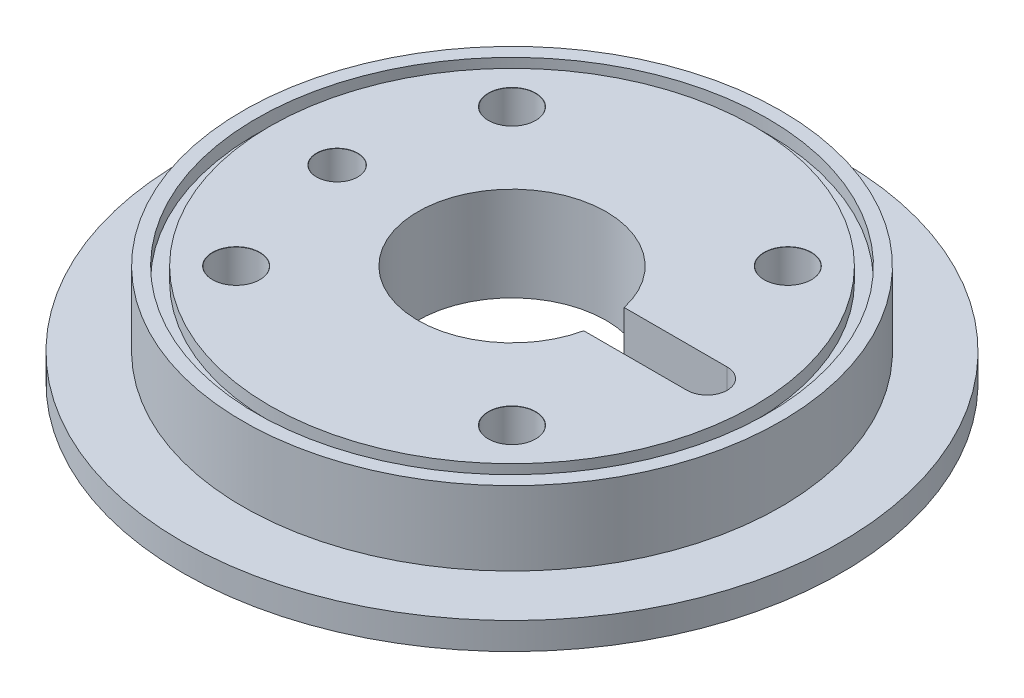
ISO-10303-21;
HEADER;
FILE_DESCRIPTION(('STEP AP214'),'2;1');
FILE_NAME('part.step','',(''),(''),'','','');
FILE_SCHEMA(('AUTOMOTIVE_DESIGN { 1 0 10303 214 1 1 1 1 }'));
ENDSEC;
DATA;
#1=APPLICATION_CONTEXT('core data for automotive mechanical design processes');
#2=APPLICATION_PROTOCOL_DEFINITION('international standard','automotive_design',2000,#1);
#3=PRODUCT_CONTEXT('',#1,'mechanical');
#4=PRODUCT('Part','Part','',(#3));
#5=PRODUCT_RELATED_PRODUCT_CATEGORY('part','',(#4));
#6=PRODUCT_DEFINITION_FORMATION('','',#4);
#7=PRODUCT_DEFINITION_CONTEXT('part definition',#1,'design');
#8=PRODUCT_DEFINITION('design','',#6,#7);
#9=PRODUCT_DEFINITION_SHAPE('','',#8);
#10=(LENGTH_UNIT() NAMED_UNIT(*) SI_UNIT(.MILLI.,.METRE.));
#11=(NAMED_UNIT(*) PLANE_ANGLE_UNIT() SI_UNIT($,.RADIAN.));
#12=(NAMED_UNIT(*) SI_UNIT($,.STERADIAN.) SOLID_ANGLE_UNIT());
#13=UNCERTAINTY_MEASURE_WITH_UNIT(LENGTH_MEASURE(1.E-05),#10,'distance_accuracy_value','');
#14=(GEOMETRIC_REPRESENTATION_CONTEXT(3) GLOBAL_UNCERTAINTY_ASSIGNED_CONTEXT((#13)) GLOBAL_UNIT_ASSIGNED_CONTEXT((#10,
#11,#12)) REPRESENTATION_CONTEXT('',''));
#15=CARTESIAN_POINT('',(0.,0.,0.));
#16=DIRECTION('',(0.,0.,1.));
#17=DIRECTION('',(1.,0.,0.));
#18=AXIS2_PLACEMENT_3D('',#15,#16,#17);
#19=CARTESIAN_POINT('',(-36.,15.,0.));
#20=DIRECTION('',(0.,-1.,0.));
#21=DIRECTION('',(0.,0.,-1.));
#22=AXIS2_PLACEMENT_3D('',#19,#20,#21);
#23=PLANE('',#22);
#24=CARTESIAN_POINT('',(20.5060966544099,15.,20.5060966544099));
#25=DIRECTION('',(0.,1.,0.));
#26=DIRECTION('',(0.,0.,1.));
#27=AXIS2_PLACEMENT_3D('',#24,#25,#26);
#28=CIRCLE('',#27,3.525);
#29=CARTESIAN_POINT('',(20.5060966544099,15.,24.0310966544099));
#30=VERTEX_POINT('',#29);
#31=EDGE_CURVE('E377',#30,#30,#28,.T.);
#32=ORIENTED_EDGE('',*,*,#31,.F.);
#33=EDGE_LOOP('',(#32));
#34=FACE_BOUND('',#33,.T.);
#35=CARTESIAN_POINT('',(20.5060966544098,15.,-20.5060966544099));
#36=DIRECTION('',(0.,1.,0.));
#37=DIRECTION('',(0.,0.,1.));
#38=AXIS2_PLACEMENT_3D('',#35,#36,#37);
#39=CIRCLE('',#38,3.525);
#40=CARTESIAN_POINT('',(20.5060966544098,15.,-16.9810966544099));
#41=VERTEX_POINT('',#40);
#42=EDGE_CURVE('E389',#41,#41,#39,.T.);
#43=ORIENTED_EDGE('',*,*,#42,.F.);
#44=EDGE_LOOP('',(#43));
#45=FACE_BOUND('',#44,.T.);
#46=CARTESIAN_POINT('',(0.,15.,0.));
#47=DIRECTION('',(0.,-1.,0.));
#48=DIRECTION('',(0.,0.,-1.));
#49=AXIS2_PLACEMENT_3D('',#46,#47,#48);
#50=CIRCLE('',#49,36.);
#51=CARTESIAN_POINT('',(0.,15.,-36.));
#52=VERTEX_POINT('',#51);
#53=EDGE_CURVE('E172',#52,#52,#50,.T.);
#54=ORIENTED_EDGE('',*,*,#53,.F.);
#55=EDGE_LOOP('',(#54));
#56=FACE_BOUND('',#55,.T.);
#57=CARTESIAN_POINT('',(0.,15.,0.));
#58=DIRECTION('',(0.,-1.,0.));
#59=DIRECTION('',(0.,0.,-1.));
#60=AXIS2_PLACEMENT_3D('',#57,#58,#59);
#61=CIRCLE('',#60,14.);
#62=CARTESIAN_POINT('',(13.6747943311773,15.,3.));
#63=VERTEX_POINT('',#62);
#64=CARTESIAN_POINT('',(13.6747943311773,15.,-3.));
#65=VERTEX_POINT('',#64);
#66=EDGE_CURVE('E176',#63,#65,#61,.T.);
#67=ORIENTED_EDGE('',*,*,#66,.T.);
#68=DIRECTION('',(-1.,0.,0.));
#69=VECTOR('',#68,1.);
#70=CARTESIAN_POINT('',(0.,15.,-3.));
#71=LINE('',#70,#69);
#72=CARTESIAN_POINT('',(29.,15.,-3.));
#73=VERTEX_POINT('',#72);
#74=EDGE_CURVE('E89',#73,#65,#71,.T.);
#75=ORIENTED_EDGE('',*,*,#74,.F.);
#76=CARTESIAN_POINT('',(29.,15.,0.));
#77=DIRECTION('',(0.,1.,0.));
#78=DIRECTION('',(0.,0.,1.));
#79=AXIS2_PLACEMENT_3D('',#76,#77,#78);
#80=CIRCLE('',#79,3.);
#81=CARTESIAN_POINT('',(29.,15.,3.));
#82=VERTEX_POINT('',#81);
#83=EDGE_CURVE('E108',#82,#73,#80,.T.);
#84=ORIENTED_EDGE('',*,*,#83,.F.);
#85=DIRECTION('',(-1.,0.,0.));
#86=VECTOR('',#85,1.);
#87=CARTESIAN_POINT('',(-36.,15.,3.));
#88=LINE('',#87,#86);
#89=EDGE_CURVE('E49',#82,#63,#88,.T.);
#90=ORIENTED_EDGE('',*,*,#89,.T.);
#91=EDGE_LOOP('',(#67,#75,#84,#90));
#92=FACE_BOUND('',#91,.T.);
#93=CARTESIAN_POINT('',(-20.5060966544098,15.,20.5060966544099));
#94=DIRECTION('',(0.,1.,0.));
#95=DIRECTION('',(0.,0.,1.));
#96=AXIS2_PLACEMENT_3D('',#93,#94,#95);
#97=CIRCLE('',#96,3.525);
#98=CARTESIAN_POINT('',(-20.5060966544098,15.,24.0310966544099));
#99=VERTEX_POINT('',#98);
#100=EDGE_CURVE('E365',#99,#99,#97,.T.);
#101=ORIENTED_EDGE('',*,*,#100,.F.);
#102=EDGE_LOOP('',(#101));
#103=FACE_BOUND('',#102,.T.);
#104=CARTESIAN_POINT('',(-20.5060966544097,15.,-20.5060966544101));
#105=DIRECTION('',(0.,1.,0.));
#106=DIRECTION('',(0.,0.,1.));
#107=AXIS2_PLACEMENT_3D('',#104,#105,#106);
#108=CIRCLE('',#107,3.525);
#109=CARTESIAN_POINT('',(-20.5060966544097,15.,-16.9810966544101));
#110=VERTEX_POINT('',#109);
#111=EDGE_CURVE('E353',#110,#110,#108,.T.);
#112=ORIENTED_EDGE('',*,*,#111,.F.);
#113=EDGE_LOOP('',(#112));
#114=FACE_BOUND('',#113,.T.);
#115=CARTESIAN_POINT('',(-26.,15.,0.));
#116=DIRECTION('',(0.,1.,0.));
#117=DIRECTION('',(0.,0.,1.));
#118=AXIS2_PLACEMENT_3D('',#115,#116,#117);
#119=CIRCLE('',#118,3.075);
#120=CARTESIAN_POINT('',(-26.,15.,3.075));
#121=VERTEX_POINT('',#120);
#122=EDGE_CURVE('E342',#121,#121,#119,.T.);
#123=ORIENTED_EDGE('',*,*,#122,.F.);
#124=EDGE_LOOP('',(#123));
#125=FACE_BOUND('',#124,.T.);
#126=ADVANCED_FACE('F40',(#34,#45,#56,#92,#103,#114,#125),#23,.F.);
#127=CARTESIAN_POINT('',(-43.,1.,0.));
#128=DIRECTION('',(0.,1.,0.));
#129=DIRECTION('',(0.,0.,1.));
#130=AXIS2_PLACEMENT_3D('',#127,#128,#129);
#131=PLANE('',#130);
#132=CARTESIAN_POINT('',(-26.,1.,0.));
#133=DIRECTION('',(0.,1.,0.));
#134=DIRECTION('',(0.,0.,1.));
#135=AXIS2_PLACEMENT_3D('',#132,#133,#134);
#136=CIRCLE('',#135,3.05);
#137=CARTESIAN_POINT('',(-26.,1.,3.05));
#138=VERTEX_POINT('',#137);
#139=EDGE_CURVE('E347',#138,#138,#136,.T.);
#140=ORIENTED_EDGE('',*,*,#139,.T.);
#141=EDGE_LOOP('',(#140));
#142=FACE_BOUND('',#141,.T.);
#143=CARTESIAN_POINT('',(-20.5060966544097,1.,-20.5060966544101));
#144=DIRECTION('',(0.,1.,0.));
#145=DIRECTION('',(0.,0.,1.));
#146=AXIS2_PLACEMENT_3D('',#143,#144,#145);
#147=CIRCLE('',#146,3.5);
#148=CARTESIAN_POINT('',(-20.5060966544097,1.,-17.0060966544101));
#149=VERTEX_POINT('',#148);
#150=EDGE_CURVE('E361',#149,#149,#147,.T.);
#151=ORIENTED_EDGE('',*,*,#150,.T.);
#152=EDGE_LOOP('',(#151));
#153=FACE_BOUND('',#152,.T.);
#154=CARTESIAN_POINT('',(-20.5060966544098,1.,20.5060966544099));
#155=DIRECTION('',(0.,1.,0.));
#156=DIRECTION('',(0.,0.,1.));
#157=AXIS2_PLACEMENT_3D('',#154,#155,#156);
#158=CIRCLE('',#157,3.5);
#159=CARTESIAN_POINT('',(-20.5060966544098,1.,24.0060966544099));
#160=VERTEX_POINT('',#159);
#161=EDGE_CURVE('E373',#160,#160,#158,.T.);
#162=ORIENTED_EDGE('',*,*,#161,.T.);
#163=EDGE_LOOP('',(#162));
#164=FACE_BOUND('',#163,.T.);
#165=CARTESIAN_POINT('',(20.5060966544099,1.,20.5060966544099));
#166=DIRECTION('',(0.,1.,0.));
#167=DIRECTION('',(0.,0.,1.));
#168=AXIS2_PLACEMENT_3D('',#165,#166,#167);
#169=CIRCLE('',#168,3.5);
#170=CARTESIAN_POINT('',(20.5060966544099,1.,24.0060966544099));
#171=VERTEX_POINT('',#170);
#172=EDGE_CURVE('E385',#171,#171,#169,.T.);
#173=ORIENTED_EDGE('',*,*,#172,.T.);
#174=EDGE_LOOP('',(#173));
#175=FACE_BOUND('',#174,.T.);
#176=CARTESIAN_POINT('',(20.5060966544098,1.,-20.5060966544099));
#177=DIRECTION('',(0.,1.,0.));
#178=DIRECTION('',(0.,0.,1.));
#179=AXIS2_PLACEMENT_3D('',#176,#177,#178);
#180=CIRCLE('',#179,3.5);
#181=CARTESIAN_POINT('',(20.5060966544098,1.,-17.0060966544099));
#182=VERTEX_POINT('',#181);
#183=EDGE_CURVE('E111',#182,#182,#180,.T.);
#184=ORIENTED_EDGE('',*,*,#183,.T.);
#185=EDGE_LOOP('',(#184));
#186=FACE_BOUND('',#185,.T.);
#187=CARTESIAN_POINT('',(0.,1.,0.));
#188=DIRECTION('',(0.,-1.,0.));
#189=DIRECTION('',(0.,0.,-1.));
#190=AXIS2_PLACEMENT_3D('',#187,#188,#189);
#191=CIRCLE('',#190,14.);
#192=CARTESIAN_POINT('',(0.,1.,-14.));
#193=VERTEX_POINT('',#192);
#194=EDGE_CURVE('E180',#193,#193,#191,.T.);
#195=ORIENTED_EDGE('',*,*,#194,.F.);
#196=EDGE_LOOP('',(#195));
#197=FACE_BOUND('',#196,.T.);
#198=CARTESIAN_POINT('',(0.,1.,0.));
#199=DIRECTION('',(0.,-1.,0.));
#200=DIRECTION('',(0.,0.,-1.));
#201=AXIS2_PLACEMENT_3D('',#198,#199,#200);
#202=CIRCLE('',#201,43.);
#203=CARTESIAN_POINT('',(0.,1.,-43.));
#204=VERTEX_POINT('',#203);
#205=EDGE_CURVE('E120',#204,#204,#202,.T.);
#206=ORIENTED_EDGE('',*,*,#205,.T.);
#207=EDGE_LOOP('',(#206));
#208=FACE_BOUND('',#207,.T.);
#209=ADVANCED_FACE('F42',(#142,#153,#164,#175,#186,#197,#208),#131,.F.);
#210=CARTESIAN_POINT('',(0.,0.,0.));
#211=DIRECTION('',(0.,-1.,0.));
#212=DIRECTION('',(0.,0.,-1.));
#213=AXIS2_PLACEMENT_3D('',#210,#211,#212);
#214=CYLINDRICAL_SURFACE('',#213,14.);
#215=CARTESIAN_POINT('',(0.,7.,0.));
#216=DIRECTION('',(0.,1.,0.));
#217=DIRECTION('',(0.,0.,1.));
#218=AXIS2_PLACEMENT_3D('',#215,#216,#217);
#219=CIRCLE('',#218,14.);
#220=CARTESIAN_POINT('',(13.6747943311773,7.,-3.));
#221=VERTEX_POINT('',#220);
#222=CARTESIAN_POINT('',(13.6747943311773,7.,3.));
#223=VERTEX_POINT('',#222);
#224=EDGE_CURVE('E11',#221,#223,#219,.F.);
#225=ORIENTED_EDGE('',*,*,#224,.F.);
#226=DIRECTION('',(0.,-1.,0.));
#227=VECTOR('',#226,1.);
#228=CARTESIAN_POINT('',(13.6747943311773,0.,-3.));
#229=LINE('',#228,#227);
#230=EDGE_CURVE('E64',#221,#65,#229,.F.);
#231=ORIENTED_EDGE('',*,*,#230,.T.);
#232=ORIENTED_EDGE('',*,*,#66,.F.);
#233=DIRECTION('',(0.,-1.,0.));
#234=VECTOR('',#233,1.);
#235=CARTESIAN_POINT('',(13.6747943311773,0.,3.));
#236=LINE('',#235,#234);
#237=EDGE_CURVE('E56',#63,#223,#236,.T.);
#238=ORIENTED_EDGE('',*,*,#237,.T.);
#239=EDGE_LOOP('',(#225,#231,#232,#238));
#240=FACE_BOUND('',#239,.T.);
#241=ORIENTED_EDGE('',*,*,#194,.T.);
#242=EDGE_LOOP('',(#241));
#243=FACE_BOUND('',#242,.T.);
#244=ADVANCED_FACE('F189',(#240,#243),#214,.F.);
#245=CARTESIAN_POINT('',(0.,0.,0.));
#246=DIRECTION('',(0.,-1.,0.));
#247=DIRECTION('',(0.,0.,-1.));
#248=AXIS2_PLACEMENT_3D('',#245,#246,#247);
#249=CYLINDRICAL_SURFACE('',#248,36.);
#250=CARTESIAN_POINT('',(0.,13.,0.));
#251=DIRECTION('',(0.,-1.,0.));
#252=DIRECTION('',(0.,0.,-1.));
#253=AXIS2_PLACEMENT_3D('',#250,#251,#252);
#254=CIRCLE('',#253,36.);
#255=CARTESIAN_POINT('',(0.,13.,-36.));
#256=VERTEX_POINT('',#255);
#257=EDGE_CURVE('E168',#256,#256,#254,.T.);
#258=ORIENTED_EDGE('',*,*,#257,.F.);
#259=EDGE_LOOP('',(#258));
#260=FACE_BOUND('',#259,.T.);
#261=ORIENTED_EDGE('',*,*,#53,.T.);
#262=EDGE_LOOP('',(#261));
#263=FACE_BOUND('',#262,.T.);
#264=ADVANCED_FACE('F192',(#260,#263),#249,.T.);
#265=CARTESIAN_POINT('',(-38.,13.,0.));
#266=DIRECTION('',(0.,-1.,0.));
#267=DIRECTION('',(0.,0.,-1.));
#268=AXIS2_PLACEMENT_3D('',#265,#266,#267);
#269=PLANE('',#268);
#270=CARTESIAN_POINT('',(0.,13.,0.));
#271=DIRECTION('',(0.,-1.,0.));
#272=DIRECTION('',(0.,0.,-1.));
#273=AXIS2_PLACEMENT_3D('',#270,#271,#272);
#274=CIRCLE('',#273,38.);
#275=CARTESIAN_POINT('',(0.,13.,-38.));
#276=VERTEX_POINT('',#275);
#277=EDGE_CURVE('E164',#276,#276,#274,.T.);
#278=ORIENTED_EDGE('',*,*,#277,.F.);
#279=EDGE_LOOP('',(#278));
#280=FACE_BOUND('',#279,.T.);
#281=ORIENTED_EDGE('',*,*,#257,.T.);
#282=EDGE_LOOP('',(#281));
#283=FACE_BOUND('',#282,.T.);
#284=ADVANCED_FACE('F263',(#280,#283),#269,.F.);
#285=CARTESIAN_POINT('',(0.,0.,0.));
#286=DIRECTION('',(0.,-1.,0.));
#287=DIRECTION('',(0.,0.,-1.));
#288=AXIS2_PLACEMENT_3D('',#285,#286,#287);
#289=CYLINDRICAL_SURFACE('',#288,38.);
#290=CARTESIAN_POINT('',(0.,15.,0.));
#291=DIRECTION('',(0.,-1.,0.));
#292=DIRECTION('',(0.,0.,-1.));
#293=AXIS2_PLACEMENT_3D('',#290,#291,#292);
#294=CIRCLE('',#293,38.);
#295=CARTESIAN_POINT('',(0.,15.,-38.));
#296=VERTEX_POINT('',#295);
#297=EDGE_CURVE('E160',#296,#296,#294,.T.);
#298=ORIENTED_EDGE('',*,*,#297,.F.);
#299=EDGE_LOOP('',(#298));
#300=FACE_BOUND('',#299,.T.);
#301=ORIENTED_EDGE('',*,*,#277,.T.);
#302=EDGE_LOOP('',(#301));
#303=FACE_BOUND('',#302,.T.);
#304=ADVANCED_FACE('F257',(#300,#303),#289,.F.);
#305=CARTESIAN_POINT('',(-40.,15.,0.));
#306=DIRECTION('',(0.,-1.,0.));
#307=DIRECTION('',(0.,0.,-1.));
#308=AXIS2_PLACEMENT_3D('',#305,#306,#307);
#309=PLANE('',#308);
#310=CARTESIAN_POINT('',(0.,15.,0.));
#311=DIRECTION('',(0.,-1.,0.));
#312=DIRECTION('',(0.,0.,-1.));
#313=AXIS2_PLACEMENT_3D('',#310,#311,#312);
#314=CIRCLE('',#313,40.);
#315=CARTESIAN_POINT('',(0.,15.,-40.));
#316=VERTEX_POINT('',#315);
#317=EDGE_CURVE('E156',#316,#316,#314,.T.);
#318=ORIENTED_EDGE('',*,*,#317,.F.);
#319=EDGE_LOOP('',(#318));
#320=FACE_BOUND('',#319,.T.);
#321=ORIENTED_EDGE('',*,*,#297,.T.);
#322=EDGE_LOOP('',(#321));
#323=FACE_BOUND('',#322,.T.);
#324=ADVANCED_FACE('F251',(#320,#323),#309,.F.);
#325=CARTESIAN_POINT('',(0.,0.,0.));
#326=DIRECTION('',(0.,-1.,0.));
#327=DIRECTION('',(0.,0.,-1.));
#328=AXIS2_PLACEMENT_3D('',#325,#326,#327);
#329=CYLINDRICAL_SURFACE('',#328,40.);
#330=CARTESIAN_POINT('',(0.,4.,0.));
#331=DIRECTION('',(0.,-1.,0.));
#332=DIRECTION('',(0.,0.,-1.));
#333=AXIS2_PLACEMENT_3D('',#330,#331,#332);
#334=CIRCLE('',#333,40.);
#335=CARTESIAN_POINT('',(0.,4.,-40.));
#336=VERTEX_POINT('',#335);
#337=EDGE_CURVE('E152',#336,#336,#334,.T.);
#338=ORIENTED_EDGE('',*,*,#337,.F.);
#339=EDGE_LOOP('',(#338));
#340=FACE_BOUND('',#339,.T.);
#341=ORIENTED_EDGE('',*,*,#317,.T.);
#342=EDGE_LOOP('',(#341));
#343=FACE_BOUND('',#342,.T.);
#344=ADVANCED_FACE('F245',(#340,#343),#329,.T.);
#345=CARTESIAN_POINT('',(-40.,4.,0.));
#346=DIRECTION('',(0.,-1.,0.));
#347=DIRECTION('',(0.,0.,-1.));
#348=AXIS2_PLACEMENT_3D('',#345,#346,#347);
#349=PLANE('',#348);
#350=CARTESIAN_POINT('',(0.,4.,0.));
#351=DIRECTION('',(0.,-1.,0.));
#352=DIRECTION('',(0.,0.,-1.));
#353=AXIS2_PLACEMENT_3D('',#350,#351,#352);
#354=CIRCLE('',#353,49.);
#355=CARTESIAN_POINT('',(0.,4.,-49.));
#356=VERTEX_POINT('',#355);
#357=EDGE_CURVE('E148',#356,#356,#354,.T.);
#358=ORIENTED_EDGE('',*,*,#357,.F.);
#359=EDGE_LOOP('',(#358));
#360=FACE_BOUND('',#359,.T.);
#361=ORIENTED_EDGE('',*,*,#337,.T.);
#362=EDGE_LOOP('',(#361));
#363=FACE_BOUND('',#362,.T.);
#364=ADVANCED_FACE('F239',(#360,#363),#349,.F.);
#365=CARTESIAN_POINT('',(0.,0.,0.));
#366=DIRECTION('',(0.,-1.,0.));
#367=DIRECTION('',(0.,0.,-1.));
#368=AXIS2_PLACEMENT_3D('',#365,#366,#367);
#369=CYLINDRICAL_SURFACE('',#368,49.);
#370=CARTESIAN_POINT('',(0.,0.,0.));
#371=DIRECTION('',(0.,-1.,0.));
#372=DIRECTION('',(0.,0.,-1.));
#373=AXIS2_PLACEMENT_3D('',#370,#371,#372);
#374=CIRCLE('',#373,49.);
#375=CARTESIAN_POINT('',(0.,0.,-49.));
#376=VERTEX_POINT('',#375);
#377=EDGE_CURVE('E144',#376,#376,#374,.T.);
#378=ORIENTED_EDGE('',*,*,#377,.F.);
#379=EDGE_LOOP('',(#378));
#380=FACE_BOUND('',#379,.T.);
#381=ORIENTED_EDGE('',*,*,#357,.T.);
#382=EDGE_LOOP('',(#381));
#383=FACE_BOUND('',#382,.T.);
#384=ADVANCED_FACE('F233',(#380,#383),#369,.T.);
#385=CARTESIAN_POINT('',(-49.,0.,0.));
#386=DIRECTION('',(0.,1.,0.));
#387=DIRECTION('',(0.,0.,1.));
#388=AXIS2_PLACEMENT_3D('',#385,#386,#387);
#389=PLANE('',#388);
#390=CARTESIAN_POINT('',(0.,0.,0.));
#391=DIRECTION('',(0.,-1.,0.));
#392=DIRECTION('',(0.,0.,-1.));
#393=AXIS2_PLACEMENT_3D('',#390,#391,#392);
#394=CIRCLE('',#393,47.);
#395=CARTESIAN_POINT('',(0.,0.,-47.));
#396=VERTEX_POINT('',#395);
#397=EDGE_CURVE('E140',#396,#396,#394,.T.);
#398=ORIENTED_EDGE('',*,*,#397,.F.);
#399=EDGE_LOOP('',(#398));
#400=FACE_BOUND('',#399,.T.);
#401=ORIENTED_EDGE('',*,*,#377,.T.);
#402=EDGE_LOOP('',(#401));
#403=FACE_BOUND('',#402,.T.);
#404=ADVANCED_FACE('F227',(#400,#403),#389,.F.);
#405=CARTESIAN_POINT('',(0.,0.,0.));
#406=DIRECTION('',(0.,-1.,0.));
#407=DIRECTION('',(0.,0.,-1.));
#408=AXIS2_PLACEMENT_3D('',#405,#406,#407);
#409=CYLINDRICAL_SURFACE('',#408,47.);
#410=CARTESIAN_POINT('',(0.,2.,0.));
#411=DIRECTION('',(0.,-1.,0.));
#412=DIRECTION('',(0.,0.,-1.));
#413=AXIS2_PLACEMENT_3D('',#410,#411,#412);
#414=CIRCLE('',#413,47.);
#415=CARTESIAN_POINT('',(0.,2.,-47.));
#416=VERTEX_POINT('',#415);
#417=EDGE_CURVE('E136',#416,#416,#414,.T.);
#418=ORIENTED_EDGE('',*,*,#417,.F.);
#419=EDGE_LOOP('',(#418));
#420=FACE_BOUND('',#419,.T.);
#421=ORIENTED_EDGE('',*,*,#397,.T.);
#422=EDGE_LOOP('',(#421));
#423=FACE_BOUND('',#422,.T.);
#424=ADVANCED_FACE('F221',(#420,#423),#409,.F.);
#425=CARTESIAN_POINT('',(-47.,2.,0.));
#426=DIRECTION('',(0.,1.,0.));
#427=DIRECTION('',(0.,0.,1.));
#428=AXIS2_PLACEMENT_3D('',#425,#426,#427);
#429=PLANE('',#428);
#430=CARTESIAN_POINT('',(0.,2.,0.));
#431=DIRECTION('',(0.,-1.,0.));
#432=DIRECTION('',(0.,0.,-1.));
#433=AXIS2_PLACEMENT_3D('',#430,#431,#432);
#434=CIRCLE('',#433,45.);
#435=CARTESIAN_POINT('',(0.,2.,-45.));
#436=VERTEX_POINT('',#435);
#437=EDGE_CURVE('E132',#436,#436,#434,.T.);
#438=ORIENTED_EDGE('',*,*,#437,.F.);
#439=EDGE_LOOP('',(#438));
#440=FACE_BOUND('',#439,.T.);
#441=ORIENTED_EDGE('',*,*,#417,.T.);
#442=EDGE_LOOP('',(#441));
#443=FACE_BOUND('',#442,.T.);
#444=ADVANCED_FACE('F215',(#440,#443),#429,.F.);
#445=CARTESIAN_POINT('',(0.,0.,0.));
#446=DIRECTION('',(0.,-1.,0.));
#447=DIRECTION('',(0.,0.,-1.));
#448=AXIS2_PLACEMENT_3D('',#445,#446,#447);
#449=CYLINDRICAL_SURFACE('',#448,45.);
#450=CARTESIAN_POINT('',(0.,0.,0.));
#451=DIRECTION('',(0.,-1.,0.));
#452=DIRECTION('',(0.,0.,-1.));
#453=AXIS2_PLACEMENT_3D('',#450,#451,#452);
#454=CIRCLE('',#453,45.);
#455=CARTESIAN_POINT('',(0.,0.,-45.));
#456=VERTEX_POINT('',#455);
#457=EDGE_CURVE('E128',#456,#456,#454,.T.);
#458=ORIENTED_EDGE('',*,*,#457,.F.);
#459=EDGE_LOOP('',(#458));
#460=FACE_BOUND('',#459,.T.);
#461=ORIENTED_EDGE('',*,*,#437,.T.);
#462=EDGE_LOOP('',(#461));
#463=FACE_BOUND('',#462,.T.);
#464=ADVANCED_FACE('F209',(#460,#463),#449,.T.);
#465=CARTESIAN_POINT('',(-45.,0.,0.));
#466=DIRECTION('',(0.,1.,0.));
#467=DIRECTION('',(0.,0.,1.));
#468=AXIS2_PLACEMENT_3D('',#465,#466,#467);
#469=PLANE('',#468);
#470=CARTESIAN_POINT('',(0.,0.,0.));
#471=DIRECTION('',(0.,-1.,0.));
#472=DIRECTION('',(0.,0.,-1.));
#473=AXIS2_PLACEMENT_3D('',#470,#471,#472);
#474=CIRCLE('',#473,43.);
#475=CARTESIAN_POINT('',(0.,0.,-43.));
#476=VERTEX_POINT('',#475);
#477=EDGE_CURVE('E124',#476,#476,#474,.T.);
#478=ORIENTED_EDGE('',*,*,#477,.F.);
#479=EDGE_LOOP('',(#478));
#480=FACE_BOUND('',#479,.T.);
#481=ORIENTED_EDGE('',*,*,#457,.T.);
#482=EDGE_LOOP('',(#481));
#483=FACE_BOUND('',#482,.T.);
#484=ADVANCED_FACE('F203',(#480,#483),#469,.F.);
#485=CARTESIAN_POINT('',(0.,0.,0.));
#486=DIRECTION('',(0.,-1.,0.));
#487=DIRECTION('',(0.,0.,-1.));
#488=AXIS2_PLACEMENT_3D('',#485,#486,#487);
#489=CYLINDRICAL_SURFACE('',#488,43.);
#490=ORIENTED_EDGE('',*,*,#205,.F.);
#491=EDGE_LOOP('',(#490));
#492=FACE_BOUND('',#491,.T.);
#493=ORIENTED_EDGE('',*,*,#477,.T.);
#494=EDGE_LOOP('',(#493));
#495=FACE_BOUND('',#494,.T.);
#496=ADVANCED_FACE('F200',(#492,#495),#489,.F.);
#497=CARTESIAN_POINT('',(0.,7.,0.));
#498=DIRECTION('',(0.,1.,0.));
#499=DIRECTION('',(0.,0.,1.));
#500=AXIS2_PLACEMENT_3D('',#497,#498,#499);
#501=PLANE('',#500);
#502=ORIENTED_EDGE('',*,*,#224,.T.);
#503=DIRECTION('',(1.,0.,0.));
#504=VECTOR('',#503,1.);
#505=CARTESIAN_POINT('',(0.,7.,3.));
#506=LINE('',#505,#504);
#507=CARTESIAN_POINT('',(29.,7.,3.));
#508=VERTEX_POINT('',#507);
#509=EDGE_CURVE('E82',#223,#508,#506,.T.);
#510=ORIENTED_EDGE('',*,*,#509,.T.);
#511=CARTESIAN_POINT('',(29.,7.,0.));
#512=DIRECTION('',(0.,1.,0.));
#513=DIRECTION('',(0.,0.,1.));
#514=AXIS2_PLACEMENT_3D('',#511,#512,#513);
#515=CIRCLE('',#514,3.);
#516=CARTESIAN_POINT('',(29.,7.,-3.));
#517=VERTEX_POINT('',#516);
#518=EDGE_CURVE('E86',#508,#517,#515,.T.);
#519=ORIENTED_EDGE('',*,*,#518,.T.);
#520=DIRECTION('',(-1.,0.,0.));
#521=VECTOR('',#520,1.);
#522=CARTESIAN_POINT('',(0.,7.,-3.));
#523=LINE('',#522,#521);
#524=EDGE_CURVE('E99',#517,#221,#523,.T.);
#525=ORIENTED_EDGE('',*,*,#524,.T.);
#526=EDGE_LOOP('',(#502,#510,#519,#525));
#527=FACE_BOUND('',#526,.T.);
#528=ADVANCED_FACE('F84',(#527),#501,.T.);
#529=CARTESIAN_POINT('',(0.,7.,-3.));
#530=DIRECTION('',(0.,0.,-1.));
#531=DIRECTION('',(-1.,0.,0.));
#532=AXIS2_PLACEMENT_3D('',#529,#530,#531);
#533=PLANE('',#532);
#534=ORIENTED_EDGE('',*,*,#524,.F.);
#535=DIRECTION('',(0.,1.,0.));
#536=VECTOR('',#535,1.);
#537=CARTESIAN_POINT('',(29.,7.,-3.));
#538=LINE('',#537,#536);
#539=EDGE_CURVE('E98',#517,#73,#538,.T.);
#540=ORIENTED_EDGE('',*,*,#539,.T.);
#541=ORIENTED_EDGE('',*,*,#74,.T.);
#542=ORIENTED_EDGE('',*,*,#230,.F.);
#543=EDGE_LOOP('',(#534,#540,#541,#542));
#544=FACE_BOUND('',#543,.T.);
#545=ADVANCED_FACE('F288',(#544),#533,.F.);
#546=CARTESIAN_POINT('',(0.,7.,3.));
#547=DIRECTION('',(0.,0.,1.));
#548=DIRECTION('',(1.,0.,0.));
#549=AXIS2_PLACEMENT_3D('',#546,#547,#548);
#550=PLANE('',#549);
#551=ORIENTED_EDGE('',*,*,#89,.F.);
#552=DIRECTION('',(0.,1.,0.));
#553=VECTOR('',#552,1.);
#554=CARTESIAN_POINT('',(29.,7.,3.));
#555=LINE('',#554,#553);
#556=EDGE_CURVE('E92',#508,#82,#555,.T.);
#557=ORIENTED_EDGE('',*,*,#556,.F.);
#558=ORIENTED_EDGE('',*,*,#509,.F.);
#559=ORIENTED_EDGE('',*,*,#237,.F.);
#560=EDGE_LOOP('',(#551,#557,#558,#559));
#561=FACE_BOUND('',#560,.T.);
#562=ADVANCED_FACE('F93',(#561),#550,.F.);
#563=CARTESIAN_POINT('',(29.,7.,0.));
#564=DIRECTION('',(0.,1.,0.));
#565=DIRECTION('',(0.,0.,1.));
#566=AXIS2_PLACEMENT_3D('',#563,#564,#565);
#567=CYLINDRICAL_SURFACE('',#566,3.);
#568=ORIENTED_EDGE('',*,*,#83,.T.);
#569=ORIENTED_EDGE('',*,*,#539,.F.);
#570=ORIENTED_EDGE('',*,*,#518,.F.);
#571=ORIENTED_EDGE('',*,*,#556,.T.);
#572=EDGE_LOOP('',(#568,#569,#570,#571));
#573=FACE_BOUND('',#572,.T.);
#574=ADVANCED_FACE('F101',(#573),#567,.F.);
#575=CARTESIAN_POINT('',(20.5060966544098,15.,-20.5060966544099));
#576=DIRECTION('',(0.,1.,0.));
#577=DIRECTION('',(0.,0.,1.));
#578=AXIS2_PLACEMENT_3D('',#575,#576,#577);
#579=CYLINDRICAL_SURFACE('',#578,3.5);
#580=ORIENTED_EDGE('',*,*,#183,.F.);
#581=EDGE_LOOP('',(#580));
#582=FACE_BOUND('',#581,.T.);
#583=CARTESIAN_POINT('',(20.5060966544098,14.975,-20.5060966544099));
#584=DIRECTION('',(0.,1.,0.));
#585=DIRECTION('',(0.,0.,1.));
#586=AXIS2_PLACEMENT_3D('',#583,#584,#585);
#587=CIRCLE('',#586,3.5);
#588=CARTESIAN_POINT('',(20.5060966544098,14.975,-17.0060966544099));
#589=VERTEX_POINT('',#588);
#590=EDGE_CURVE('E393',#589,#589,#587,.T.);
#591=ORIENTED_EDGE('',*,*,#590,.T.);
#592=EDGE_LOOP('',(#591));
#593=FACE_BOUND('',#592,.T.);
#594=ADVANCED_FACE('F291',(#582,#593),#579,.F.);
#595=CARTESIAN_POINT('',(20.5060966544098,15.,-20.5060966544099));
#596=DIRECTION('',(0.,1.,0.));
#597=DIRECTION('',(0.,0.,1.));
#598=AXIS2_PLACEMENT_3D('',#595,#596,#597);
#599=CONICAL_SURFACE('',#598,3.525,0.785398163397414);
#600=ORIENTED_EDGE('',*,*,#590,.F.);
#601=EDGE_LOOP('',(#600));
#602=FACE_BOUND('',#601,.T.);
#603=ORIENTED_EDGE('',*,*,#42,.T.);
#604=EDGE_LOOP('',(#603));
#605=FACE_BOUND('',#604,.T.);
#606=ADVANCED_FACE('F298',(#602,#605),#599,.F.);
#607=CARTESIAN_POINT('',(20.5060966544099,15.,20.5060966544099));
#608=DIRECTION('',(0.,1.,0.));
#609=DIRECTION('',(0.,0.,1.));
#610=AXIS2_PLACEMENT_3D('',#607,#608,#609);
#611=CYLINDRICAL_SURFACE('',#610,3.5);
#612=ORIENTED_EDGE('',*,*,#172,.F.);
#613=EDGE_LOOP('',(#612));
#614=FACE_BOUND('',#613,.T.);
#615=CARTESIAN_POINT('',(20.5060966544099,14.975,20.5060966544099));
#616=DIRECTION('',(0.,1.,0.));
#617=DIRECTION('',(0.,0.,1.));
#618=AXIS2_PLACEMENT_3D('',#615,#616,#617);
#619=CIRCLE('',#618,3.5);
#620=CARTESIAN_POINT('',(20.5060966544099,14.975,24.0060966544099));
#621=VERTEX_POINT('',#620);
#622=EDGE_CURVE('E381',#621,#621,#619,.T.);
#623=ORIENTED_EDGE('',*,*,#622,.T.);
#624=EDGE_LOOP('',(#623));
#625=FACE_BOUND('',#624,.T.);
#626=ADVANCED_FACE('F302',(#614,#625),#611,.F.);
#627=CARTESIAN_POINT('',(20.5060966544099,15.,20.5060966544099));
#628=DIRECTION('',(0.,1.,0.));
#629=DIRECTION('',(0.,0.,1.));
#630=AXIS2_PLACEMENT_3D('',#627,#628,#629);
#631=CONICAL_SURFACE('',#630,3.525,0.785398163397414);
#632=ORIENTED_EDGE('',*,*,#622,.F.);
#633=EDGE_LOOP('',(#632));
#634=FACE_BOUND('',#633,.T.);
#635=ORIENTED_EDGE('',*,*,#31,.T.);
#636=EDGE_LOOP('',(#635));
#637=FACE_BOUND('',#636,.T.);
#638=ADVANCED_FACE('F306',(#634,#637),#631,.F.);
#639=CARTESIAN_POINT('',(-20.5060966544098,15.,20.5060966544099));
#640=DIRECTION('',(0.,1.,0.));
#641=DIRECTION('',(0.,0.,1.));
#642=AXIS2_PLACEMENT_3D('',#639,#640,#641);
#643=CYLINDRICAL_SURFACE('',#642,3.5);
#644=ORIENTED_EDGE('',*,*,#161,.F.);
#645=EDGE_LOOP('',(#644));
#646=FACE_BOUND('',#645,.T.);
#647=CARTESIAN_POINT('',(-20.5060966544098,14.975,20.5060966544099));
#648=DIRECTION('',(0.,1.,0.));
#649=DIRECTION('',(0.,0.,1.));
#650=AXIS2_PLACEMENT_3D('',#647,#648,#649);
#651=CIRCLE('',#650,3.5);
#652=CARTESIAN_POINT('',(-20.5060966544098,14.975,24.0060966544099));
#653=VERTEX_POINT('',#652);
#654=EDGE_CURVE('E369',#653,#653,#651,.T.);
#655=ORIENTED_EDGE('',*,*,#654,.T.);
#656=EDGE_LOOP('',(#655));
#657=FACE_BOUND('',#656,.T.);
#658=ADVANCED_FACE('F310',(#646,#657),#643,.F.);
#659=CARTESIAN_POINT('',(-20.5060966544098,15.,20.5060966544099));
#660=DIRECTION('',(0.,1.,0.));
#661=DIRECTION('',(0.,0.,1.));
#662=AXIS2_PLACEMENT_3D('',#659,#660,#661);
#663=CONICAL_SURFACE('',#662,3.525,0.785398163397414);
#664=ORIENTED_EDGE('',*,*,#654,.F.);
#665=EDGE_LOOP('',(#664));
#666=FACE_BOUND('',#665,.T.);
#667=ORIENTED_EDGE('',*,*,#100,.T.);
#668=EDGE_LOOP('',(#667));
#669=FACE_BOUND('',#668,.T.);
#670=ADVANCED_FACE('F314',(#666,#669),#663,.F.);
#671=CARTESIAN_POINT('',(-20.5060966544097,15.,-20.5060966544101));
#672=DIRECTION('',(0.,1.,0.));
#673=DIRECTION('',(0.,0.,1.));
#674=AXIS2_PLACEMENT_3D('',#671,#672,#673);
#675=CYLINDRICAL_SURFACE('',#674,3.5);
#676=ORIENTED_EDGE('',*,*,#150,.F.);
#677=EDGE_LOOP('',(#676));
#678=FACE_BOUND('',#677,.T.);
#679=CARTESIAN_POINT('',(-20.5060966544097,14.975,-20.5060966544101));
#680=DIRECTION('',(0.,1.,0.));
#681=DIRECTION('',(0.,0.,1.));
#682=AXIS2_PLACEMENT_3D('',#679,#680,#681);
#683=CIRCLE('',#682,3.5);
#684=CARTESIAN_POINT('',(-20.5060966544097,14.975,-17.0060966544101));
#685=VERTEX_POINT('',#684);
#686=EDGE_CURVE('E357',#685,#685,#683,.T.);
#687=ORIENTED_EDGE('',*,*,#686,.T.);
#688=EDGE_LOOP('',(#687));
#689=FACE_BOUND('',#688,.T.);
#690=ADVANCED_FACE('F318',(#678,#689),#675,.F.);
#691=CARTESIAN_POINT('',(-20.5060966544097,15.,-20.5060966544101));
#692=DIRECTION('',(0.,1.,0.));
#693=DIRECTION('',(0.,0.,1.));
#694=AXIS2_PLACEMENT_3D('',#691,#692,#693);
#695=CONICAL_SURFACE('',#694,3.525,0.785398163397414);
#696=ORIENTED_EDGE('',*,*,#686,.F.);
#697=EDGE_LOOP('',(#696));
#698=FACE_BOUND('',#697,.T.);
#699=ORIENTED_EDGE('',*,*,#111,.T.);
#700=EDGE_LOOP('',(#699));
#701=FACE_BOUND('',#700,.T.);
#702=ADVANCED_FACE('F322',(#698,#701),#695,.F.);
#703=CARTESIAN_POINT('',(-26.,15.,0.));
#704=DIRECTION('',(0.,1.,0.));
#705=DIRECTION('',(0.,0.,1.));
#706=AXIS2_PLACEMENT_3D('',#703,#704,#705);
#707=CYLINDRICAL_SURFACE('',#706,3.05);
#708=ORIENTED_EDGE('',*,*,#139,.F.);
#709=EDGE_LOOP('',(#708));
#710=FACE_BOUND('',#709,.T.);
#711=CARTESIAN_POINT('',(-26.,14.975,0.));
#712=DIRECTION('',(0.,1.,0.));
#713=DIRECTION('',(0.,0.,1.));
#714=AXIS2_PLACEMENT_3D('',#711,#712,#713);
#715=CIRCLE('',#714,3.05);
#716=CARTESIAN_POINT('',(-26.,14.975,3.05));
#717=VERTEX_POINT('',#716);
#718=EDGE_CURVE('E339',#717,#717,#715,.T.);
#719=ORIENTED_EDGE('',*,*,#718,.T.);
#720=EDGE_LOOP('',(#719));
#721=FACE_BOUND('',#720,.T.);
#722=ADVANCED_FACE('F326',(#710,#721),#707,.F.);
#723=CARTESIAN_POINT('',(-26.,15.,0.));
#724=DIRECTION('',(0.,1.,0.));
#725=DIRECTION('',(0.,0.,1.));
#726=AXIS2_PLACEMENT_3D('',#723,#724,#725);
#727=CONICAL_SURFACE('',#726,3.075,0.785398163397414);
#728=ORIENTED_EDGE('',*,*,#718,.F.);
#729=EDGE_LOOP('',(#728));
#730=FACE_BOUND('',#729,.T.);
#731=ORIENTED_EDGE('',*,*,#122,.T.);
#732=EDGE_LOOP('',(#731));
#733=FACE_BOUND('',#732,.T.);
#734=ADVANCED_FACE('F330',(#730,#733),#727,.F.);
#735=CLOSED_SHELL('',(#126,#209,#244,#264,#284,#304,#324,#344,#364,#384,#404,#424,#444,#464,
#484,#496,#528,#545,#562,#574,#594,#606,#626,#638,#658,#670,#690,#702,#722,#734));
#736=MANIFOLD_SOLID_BREP('B2',#735);
#737=ADVANCED_BREP_SHAPE_REPRESENTATION('',(#18,#736),#14);
#738=SHAPE_DEFINITION_REPRESENTATION(#9,#737);
ENDSEC;
END-ISO-10303-21;
